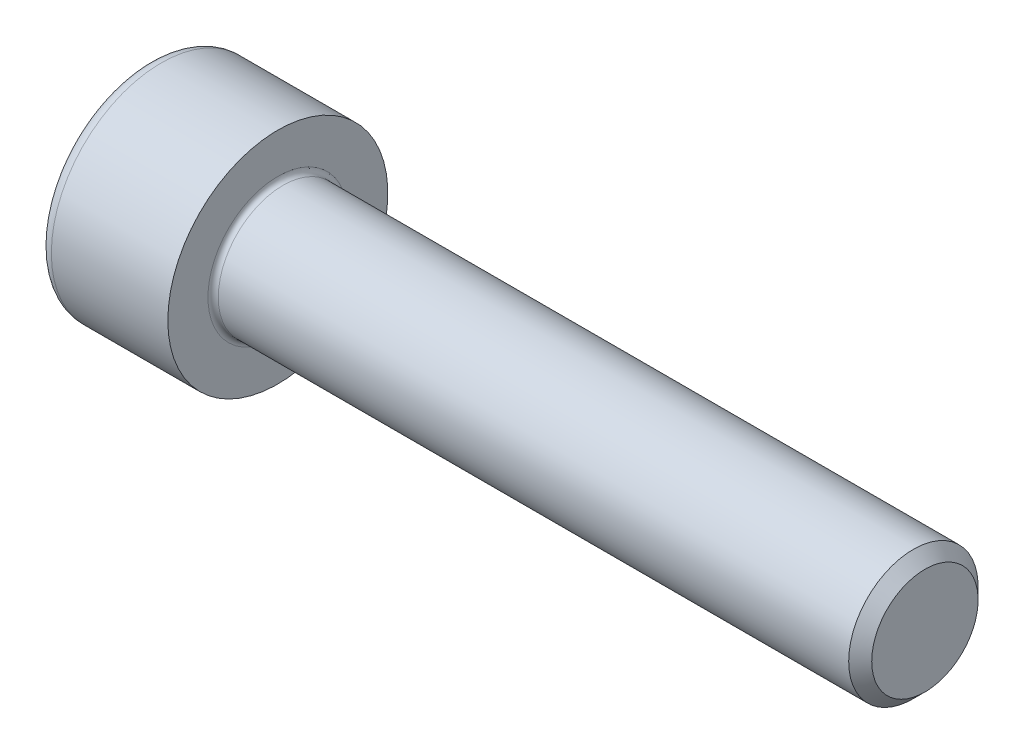
ISO-10303-21;
HEADER;
FILE_DESCRIPTION(('STEP AP214'),'2;1');
FILE_NAME('part.step','',(''),(''),'','','');
FILE_SCHEMA(('AUTOMOTIVE_DESIGN { 1 0 10303 214 1 1 1 1 }'));
ENDSEC;
DATA;
#1=APPLICATION_CONTEXT('core data for automotive mechanical design processes');
#2=APPLICATION_PROTOCOL_DEFINITION('international standard','automotive_design',2000,#1);
#3=PRODUCT_CONTEXT('',#1,'mechanical');
#4=PRODUCT('Part','Part','',(#3));
#5=PRODUCT_RELATED_PRODUCT_CATEGORY('part','',(#4));
#6=PRODUCT_DEFINITION_FORMATION('','',#4);
#7=PRODUCT_DEFINITION_CONTEXT('part definition',#1,'design');
#8=PRODUCT_DEFINITION('design','',#6,#7);
#9=PRODUCT_DEFINITION_SHAPE('','',#8);
#10=(LENGTH_UNIT() NAMED_UNIT(*) SI_UNIT(.MILLI.,.METRE.));
#11=(NAMED_UNIT(*) PLANE_ANGLE_UNIT() SI_UNIT($,.RADIAN.));
#12=(NAMED_UNIT(*) SI_UNIT($,.STERADIAN.) SOLID_ANGLE_UNIT());
#13=UNCERTAINTY_MEASURE_WITH_UNIT(LENGTH_MEASURE(1.E-05),#10,'distance_accuracy_value','');
#14=(GEOMETRIC_REPRESENTATION_CONTEXT(3) GLOBAL_UNCERTAINTY_ASSIGNED_CONTEXT((#13)) GLOBAL_UNIT_ASSIGNED_CONTEXT((#10,
#11,#12)) REPRESENTATION_CONTEXT('',''));
#15=CARTESIAN_POINT('',(0.,0.,0.));
#16=DIRECTION('',(0.,0.,1.));
#17=DIRECTION('',(1.,0.,0.));
#18=AXIS2_PLACEMENT_3D('',#15,#16,#17);
#19=CARTESIAN_POINT('',(0.,0.,0.));
#20=DIRECTION('',(-1.,0.,0.));
#21=DIRECTION('',(0.,0.,1.));
#22=AXIS2_PLACEMENT_3D('',#19,#20,#21);
#23=PLANE('',#22);
#24=DIRECTION('',(0.,-0.499999999999999,0.866025403784439));
#25=VECTOR('',#24,1.);
#26=CARTESIAN_POINT('',(0.,2.32094808214229,0.));
#27=LINE('',#26,#25);
#28=CARTESIAN_POINT('',(0.,2.32094808214229,0.));
#29=VERTEX_POINT('',#28);
#30=CARTESIAN_POINT('',(0.,1.16047404107114,2.01));
#31=VERTEX_POINT('',#30);
#32=EDGE_CURVE('E262',#29,#31,#27,.T.);
#33=ORIENTED_EDGE('',*,*,#32,.T.);
#34=DIRECTION('',(0.,1.,0.));
#35=VECTOR('',#34,1.);
#36=CARTESIAN_POINT('',(0.,-1.16047404107115,2.01));
#37=LINE('',#36,#35);
#38=CARTESIAN_POINT('',(0.,-1.16047404107115,2.01));
#39=VERTEX_POINT('',#38);
#40=EDGE_CURVE('E134',#39,#31,#37,.T.);
#41=ORIENTED_EDGE('',*,*,#40,.F.);
#42=DIRECTION('',(0.,-0.500000000000001,-0.866025403784438));
#43=VECTOR('',#42,1.);
#44=CARTESIAN_POINT('',(0.,-1.16047404107115,2.01));
#45=LINE('',#44,#43);
#46=CARTESIAN_POINT('',(0.,-2.3209480821423,0.));
#47=VERTEX_POINT('',#46);
#48=EDGE_CURVE('E265',#39,#47,#45,.T.);
#49=ORIENTED_EDGE('',*,*,#48,.T.);
#50=DIRECTION('',(0.,0.499999999999999,-0.866025403784439));
#51=VECTOR('',#50,1.);
#52=CARTESIAN_POINT('',(0.,-2.3209480821423,0.));
#53=LINE('',#52,#51);
#54=CARTESIAN_POINT('',(0.,-1.16047404107116,-2.01));
#55=VERTEX_POINT('',#54);
#56=EDGE_CURVE('E268',#47,#55,#53,.T.);
#57=ORIENTED_EDGE('',*,*,#56,.T.);
#58=DIRECTION('',(0.,-1.,0.));
#59=VECTOR('',#58,1.);
#60=CARTESIAN_POINT('',(0.,1.16047404107114,-2.01));
#61=LINE('',#60,#59);
#62=CARTESIAN_POINT('',(0.,1.16047404107114,-2.01));
#63=VERTEX_POINT('',#62);
#64=EDGE_CURVE('E271',#63,#55,#61,.T.);
#65=ORIENTED_EDGE('',*,*,#64,.F.);
#66=DIRECTION('',(0.,-0.500000000000001,-0.866025403784438));
#67=VECTOR('',#66,1.);
#68=CARTESIAN_POINT('',(0.,2.32094808214229,0.));
#69=LINE('',#68,#67);
#70=EDGE_CURVE('E129',#29,#63,#69,.T.);
#71=ORIENTED_EDGE('',*,*,#70,.F.);
#72=EDGE_LOOP('',(#33,#41,#49,#57,#65,#71));
#73=FACE_BOUND('',#72,.T.);
#74=CARTESIAN_POINT('',(0.,0.,0.));
#75=DIRECTION('',(-1.,0.,0.));
#76=DIRECTION('',(0.,0.,1.));
#77=AXIS2_PLACEMENT_3D('',#74,#75,#76);
#78=CIRCLE('',#77,3.75);
#79=CARTESIAN_POINT('',(0.,0.,3.75));
#80=VERTEX_POINT('',#79);
#81=EDGE_CURVE('E46',#80,#80,#78,.T.);
#82=ORIENTED_EDGE('',*,*,#81,.T.);
#83=EDGE_LOOP('',(#82));
#84=FACE_BOUND('',#83,.T.);
#85=ADVANCED_FACE('F38',(#73,#84),#23,.T.);
#86=CARTESIAN_POINT('',(-31.75,0.,0.));
#87=DIRECTION('',(-1.,0.,0.));
#88=DIRECTION('',(0.,0.,1.));
#89=AXIS2_PLACEMENT_3D('',#86,#87,#88);
#90=CYLINDRICAL_SURFACE('',#89,4.25);
#91=CARTESIAN_POINT('',(0.5,0.,0.));
#92=DIRECTION('',(-1.,0.,0.));
#93=DIRECTION('',(0.,0.,1.));
#94=AXIS2_PLACEMENT_3D('',#91,#92,#93);
#95=CIRCLE('',#94,4.25);
#96=CARTESIAN_POINT('',(0.5,0.,4.25));
#97=VERTEX_POINT('',#96);
#98=EDGE_CURVE('E11',#97,#97,#95,.F.);
#99=ORIENTED_EDGE('',*,*,#98,.T.);
#100=EDGE_LOOP('',(#99));
#101=FACE_BOUND('',#100,.T.);
#102=CARTESIAN_POINT('',(5.,0.,0.));
#103=DIRECTION('',(-1.,0.,0.));
#104=DIRECTION('',(0.,0.,1.));
#105=AXIS2_PLACEMENT_3D('',#102,#103,#104);
#106=CIRCLE('',#105,4.25);
#107=CARTESIAN_POINT('',(5.,0.,4.25));
#108=VERTEX_POINT('',#107);
#109=EDGE_CURVE('E152',#108,#108,#106,.T.);
#110=ORIENTED_EDGE('',*,*,#109,.T.);
#111=EDGE_LOOP('',(#110));
#112=FACE_BOUND('',#111,.T.);
#113=ADVANCED_FACE('F176',(#101,#112),#90,.T.);
#114=CARTESIAN_POINT('',(5.,4.25,0.));
#115=DIRECTION('',(1.,0.,0.));
#116=DIRECTION('',(0.,0.,-1.));
#117=AXIS2_PLACEMENT_3D('',#114,#115,#116);
#118=PLANE('',#117);
#119=CARTESIAN_POINT('',(5.,0.,0.));
#120=DIRECTION('',(1.,0.,0.));
#121=DIRECTION('',(0.,0.,-1.));
#122=AXIS2_PLACEMENT_3D('',#119,#120,#121);
#123=CIRCLE('',#122,2.69999999999999);
#124=CARTESIAN_POINT('',(5.,0.,-2.69999999999999));
#125=VERTEX_POINT('',#124);
#126=EDGE_CURVE('E155',#125,#125,#123,.F.);
#127=ORIENTED_EDGE('',*,*,#126,.T.);
#128=EDGE_LOOP('',(#127));
#129=FACE_BOUND('',#128,.T.);
#130=ORIENTED_EDGE('',*,*,#109,.F.);
#131=EDGE_LOOP('',(#130));
#132=FACE_BOUND('',#131,.T.);
#133=ADVANCED_FACE('F182',(#129,#132),#118,.T.);
#134=CARTESIAN_POINT('',(-31.75,0.,0.));
#135=DIRECTION('',(-1.,0.,0.));
#136=DIRECTION('',(0.,0.,1.));
#137=AXIS2_PLACEMENT_3D('',#134,#135,#136);
#138=CYLINDRICAL_SURFACE('',#137,2.49999999999999);
#139=CARTESIAN_POINT('',(5.2,0.,0.));
#140=DIRECTION('',(1.,0.,0.));
#141=DIRECTION('',(0.,0.,-1.));
#142=AXIS2_PLACEMENT_3D('',#139,#140,#141);
#143=CIRCLE('',#142,2.49999999999999);
#144=CARTESIAN_POINT('',(5.2,0.,-2.49999999999999));
#145=VERTEX_POINT('',#144);
#146=EDGE_CURVE('E158',#145,#145,#143,.T.);
#147=ORIENTED_EDGE('',*,*,#146,.T.);
#148=EDGE_LOOP('',(#147));
#149=FACE_BOUND('',#148,.T.);
#150=CARTESIAN_POINT('',(29.555,0.,0.));
#151=DIRECTION('',(-1.,0.,0.));
#152=DIRECTION('',(0.,0.,1.));
#153=AXIS2_PLACEMENT_3D('',#150,#151,#152);
#154=CIRCLE('',#153,2.49999999999998);
#155=CARTESIAN_POINT('',(29.555,0.,2.49999999999998));
#156=VERTEX_POINT('',#155);
#157=EDGE_CURVE('E149',#156,#156,#154,.T.);
#158=ORIENTED_EDGE('',*,*,#157,.T.);
#159=EDGE_LOOP('',(#158));
#160=FACE_BOUND('',#159,.T.);
#161=ADVANCED_FACE('F188',(#149,#160),#138,.T.);
#162=CARTESIAN_POINT('',(30.,0.,0.));
#163=DIRECTION('',(-1.,0.,0.));
#164=DIRECTION('',(0.,0.,1.));
#165=AXIS2_PLACEMENT_3D('',#162,#163,#164);
#166=CONICAL_SURFACE('',#165,2.055,0.785398163397404);
#167=ORIENTED_EDGE('',*,*,#157,.F.);
#168=EDGE_LOOP('',(#167));
#169=FACE_BOUND('',#168,.T.);
#170=CARTESIAN_POINT('',(30.,0.,0.));
#171=DIRECTION('',(-1.,0.,0.));
#172=DIRECTION('',(0.,0.,1.));
#173=AXIS2_PLACEMENT_3D('',#170,#171,#172);
#174=CIRCLE('',#173,2.055);
#175=CARTESIAN_POINT('',(30.,0.,2.055));
#176=VERTEX_POINT('',#175);
#177=EDGE_CURVE('E145',#176,#176,#174,.T.);
#178=ORIENTED_EDGE('',*,*,#177,.T.);
#179=EDGE_LOOP('',(#178));
#180=FACE_BOUND('',#179,.T.);
#181=ADVANCED_FACE('F192',(#169,#180),#166,.T.);
#182=CARTESIAN_POINT('',(30.,2.055,0.));
#183=DIRECTION('',(1.,0.,0.));
#184=DIRECTION('',(0.,0.,-1.));
#185=AXIS2_PLACEMENT_3D('',#182,#183,#184);
#186=PLANE('',#185);
#187=ORIENTED_EDGE('',*,*,#177,.F.);
#188=EDGE_LOOP('',(#187));
#189=FACE_BOUND('',#188,.T.);
#190=ADVANCED_FACE('F172',(#189),#186,.T.);
#191=CARTESIAN_POINT('',(5.2,0.,0.));
#192=DIRECTION('',(1.,0.,0.));
#193=DIRECTION('',(0.,0.,-1.));
#194=AXIS2_PLACEMENT_3D('',#191,#192,#193);
#195=TOROIDAL_SURFACE('',#194,2.69999999999999,0.2);
#196=ORIENTED_EDGE('',*,*,#146,.F.);
#197=EDGE_LOOP('',(#196));
#198=FACE_BOUND('',#197,.T.);
#199=ORIENTED_EDGE('',*,*,#126,.F.);
#200=EDGE_LOOP('',(#199));
#201=FACE_BOUND('',#200,.T.);
#202=ADVANCED_FACE('F165',(#198,#201),#195,.F.);
#203=CARTESIAN_POINT('',(0.5,0.,0.));
#204=DIRECTION('',(-1.,0.,0.));
#205=DIRECTION('',(0.,0.,1.));
#206=AXIS2_PLACEMENT_3D('',#203,#204,#205);
#207=TOROIDAL_SURFACE('',#206,3.75,0.5);
#208=ORIENTED_EDGE('',*,*,#98,.F.);
#209=EDGE_LOOP('',(#208));
#210=FACE_BOUND('',#209,.T.);
#211=ORIENTED_EDGE('',*,*,#81,.F.);
#212=EDGE_LOOP('',(#211));
#213=FACE_BOUND('',#212,.T.);
#214=ADVANCED_FACE('F40',(#210,#213),#207,.T.);
#215=CARTESIAN_POINT('',(2.5,2.32094808214229,0.));
#216=DIRECTION('',(0.,-0.866025403784439,-0.499999999999999));
#217=DIRECTION('',(0.,0.499999999999999,-0.866025403784439));
#218=AXIS2_PLACEMENT_3D('',#215,#216,#217);
#219=PLANE('',#218);
#220=ORIENTED_EDGE('',*,*,#32,.F.);
#221=DIRECTION('',(-1.,0.,0.));
#222=VECTOR('',#221,1.);
#223=CARTESIAN_POINT('',(2.5,2.32094808214229,0.));
#224=LINE('',#223,#222);
#225=CARTESIAN_POINT('',(2.5,2.32094808214229,0.));
#226=VERTEX_POINT('',#225);
#227=EDGE_CURVE('E252',#226,#29,#224,.T.);
#228=ORIENTED_EDGE('',*,*,#227,.F.);
#229=DIRECTION('',(0.,-0.499999999999999,0.866025403784439));
#230=VECTOR('',#229,1.);
#231=CARTESIAN_POINT('',(2.5,2.32094808214229,0.));
#232=LINE('',#231,#230);
#233=CARTESIAN_POINT('',(2.5,1.74071106160672,1.00499999999999));
#234=VERTEX_POINT('',#233);
#235=EDGE_CURVE('E121',#226,#234,#232,.T.);
#236=ORIENTED_EDGE('',*,*,#235,.T.);
#237=CARTESIAN_POINT('',(2.5,1.16047404107114,2.01));
#238=VERTEX_POINT('',#237);
#239=EDGE_CURVE('E112',#234,#238,#232,.T.);
#240=ORIENTED_EDGE('',*,*,#239,.T.);
#241=DIRECTION('',(-1.,0.,0.));
#242=VECTOR('',#241,1.);
#243=CARTESIAN_POINT('',(2.5,1.16047404107114,2.01));
#244=LINE('',#243,#242);
#245=EDGE_CURVE('E126',#238,#31,#244,.T.);
#246=ORIENTED_EDGE('',*,*,#245,.T.);
#247=EDGE_LOOP('',(#220,#228,#236,#240,#246));
#248=FACE_BOUND('',#247,.T.);
#249=ADVANCED_FACE('F125',(#248),#219,.T.);
#250=CARTESIAN_POINT('',(2.5,-1.16047404107115,2.01));
#251=DIRECTION('',(0.,0.,1.));
#252=DIRECTION('',(0.,-1.,0.));
#253=AXIS2_PLACEMENT_3D('',#250,#251,#252);
#254=PLANE('',#253);
#255=ORIENTED_EDGE('',*,*,#40,.T.);
#256=ORIENTED_EDGE('',*,*,#245,.F.);
#257=DIRECTION('',(0.,1.,0.));
#258=VECTOR('',#257,1.);
#259=CARTESIAN_POINT('',(2.5,-1.16047404107115,2.01));
#260=LINE('',#259,#258);
#261=CARTESIAN_POINT('',(2.5,0.,2.01));
#262=VERTEX_POINT('',#261);
#263=EDGE_CURVE('E109',#262,#238,#260,.T.);
#264=ORIENTED_EDGE('',*,*,#263,.F.);
#265=CARTESIAN_POINT('',(2.5,-1.16047404107115,2.01));
#266=VERTEX_POINT('',#265);
#267=EDGE_CURVE('E120',#266,#262,#260,.T.);
#268=ORIENTED_EDGE('',*,*,#267,.F.);
#269=DIRECTION('',(-1.,0.,0.));
#270=VECTOR('',#269,1.);
#271=CARTESIAN_POINT('',(2.5,-1.16047404107115,2.01));
#272=LINE('',#271,#270);
#273=EDGE_CURVE('E136',#266,#39,#272,.T.);
#274=ORIENTED_EDGE('',*,*,#273,.T.);
#275=EDGE_LOOP('',(#255,#256,#264,#268,#274));
#276=FACE_BOUND('',#275,.T.);
#277=ADVANCED_FACE('F131',(#276),#254,.F.);
#278=CARTESIAN_POINT('',(2.5,-1.16047404107115,2.01));
#279=DIRECTION('',(0.,0.866025403784438,-0.500000000000001));
#280=DIRECTION('',(0.,0.500000000000001,0.866025403784438));
#281=AXIS2_PLACEMENT_3D('',#278,#279,#280);
#282=PLANE('',#281);
#283=ORIENTED_EDGE('',*,*,#48,.F.);
#284=ORIENTED_EDGE('',*,*,#273,.F.);
#285=DIRECTION('',(0.,-0.500000000000001,-0.866025403784438));
#286=VECTOR('',#285,1.);
#287=CARTESIAN_POINT('',(2.5,-1.16047404107115,2.01));
#288=LINE('',#287,#286);
#289=CARTESIAN_POINT('',(2.5,-1.74071106160672,1.005));
#290=VERTEX_POINT('',#289);
#291=EDGE_CURVE('E291',#266,#290,#288,.T.);
#292=ORIENTED_EDGE('',*,*,#291,.T.);
#293=CARTESIAN_POINT('',(2.5,-2.3209480821423,0.));
#294=VERTEX_POINT('',#293);
#295=EDGE_CURVE('E280',#290,#294,#288,.T.);
#296=ORIENTED_EDGE('',*,*,#295,.T.);
#297=DIRECTION('',(-1.,0.,0.));
#298=VECTOR('',#297,1.);
#299=CARTESIAN_POINT('',(2.5,-2.3209480821423,0.));
#300=LINE('',#299,#298);
#301=EDGE_CURVE('E141',#294,#47,#300,.T.);
#302=ORIENTED_EDGE('',*,*,#301,.T.);
#303=EDGE_LOOP('',(#283,#284,#292,#296,#302));
#304=FACE_BOUND('',#303,.T.);
#305=ADVANCED_FACE('F206',(#304),#282,.T.);
#306=CARTESIAN_POINT('',(2.5,-2.3209480821423,0.));
#307=DIRECTION('',(0.,0.866025403784439,0.499999999999999));
#308=DIRECTION('',(0.,-0.499999999999999,0.866025403784439));
#309=AXIS2_PLACEMENT_3D('',#306,#307,#308);
#310=PLANE('',#309);
#311=ORIENTED_EDGE('',*,*,#56,.F.);
#312=ORIENTED_EDGE('',*,*,#301,.F.);
#313=DIRECTION('',(0.,0.499999999999999,-0.866025403784439));
#314=VECTOR('',#313,1.);
#315=CARTESIAN_POINT('',(2.5,-2.3209480821423,0.));
#316=LINE('',#315,#314);
#317=CARTESIAN_POINT('',(2.5,-1.74071106160673,-1.005));
#318=VERTEX_POINT('',#317);
#319=EDGE_CURVE('E258',#294,#318,#316,.T.);
#320=ORIENTED_EDGE('',*,*,#319,.T.);
#321=CARTESIAN_POINT('',(2.5,-1.16047404107116,-2.01));
#322=VERTEX_POINT('',#321);
#323=EDGE_CURVE('E290',#318,#322,#316,.T.);
#324=ORIENTED_EDGE('',*,*,#323,.T.);
#325=DIRECTION('',(-1.,0.,0.));
#326=VECTOR('',#325,1.);
#327=CARTESIAN_POINT('',(2.5,-1.16047404107116,-2.01));
#328=LINE('',#327,#326);
#329=EDGE_CURVE('E251',#322,#55,#328,.T.);
#330=ORIENTED_EDGE('',*,*,#329,.T.);
#331=EDGE_LOOP('',(#311,#312,#320,#324,#330));
#332=FACE_BOUND('',#331,.T.);
#333=ADVANCED_FACE('F209',(#332),#310,.T.);
#334=CARTESIAN_POINT('',(2.5,1.16047404107114,-2.01));
#335=DIRECTION('',(0.,0.,-1.));
#336=DIRECTION('',(0.,1.,0.));
#337=AXIS2_PLACEMENT_3D('',#334,#335,#336);
#338=PLANE('',#337);
#339=ORIENTED_EDGE('',*,*,#64,.T.);
#340=ORIENTED_EDGE('',*,*,#329,.F.);
#341=DIRECTION('',(0.,-1.,0.));
#342=VECTOR('',#341,1.);
#343=CARTESIAN_POINT('',(2.5,1.16047404107114,-2.01));
#344=LINE('',#343,#342);
#345=CARTESIAN_POINT('',(2.5,0.,-2.01));
#346=VERTEX_POINT('',#345);
#347=EDGE_CURVE('E255',#346,#322,#344,.T.);
#348=ORIENTED_EDGE('',*,*,#347,.F.);
#349=CARTESIAN_POINT('',(2.5,1.16047404107114,-2.01));
#350=VERTEX_POINT('',#349);
#351=EDGE_CURVE('E53',#350,#346,#344,.T.);
#352=ORIENTED_EDGE('',*,*,#351,.F.);
#353=DIRECTION('',(-1.,0.,0.));
#354=VECTOR('',#353,1.);
#355=CARTESIAN_POINT('',(2.5,1.16047404107114,-2.01));
#356=LINE('',#355,#354);
#357=EDGE_CURVE('E248',#350,#63,#356,.T.);
#358=ORIENTED_EDGE('',*,*,#357,.T.);
#359=EDGE_LOOP('',(#339,#340,#348,#352,#358));
#360=FACE_BOUND('',#359,.T.);
#361=ADVANCED_FACE('F213',(#360),#338,.F.);
#362=CARTESIAN_POINT('',(2.5,2.32094808214229,0.));
#363=DIRECTION('',(0.,0.866025403784438,-0.500000000000001));
#364=DIRECTION('',(0.,0.500000000000001,0.866025403784438));
#365=AXIS2_PLACEMENT_3D('',#362,#363,#364);
#366=PLANE('',#365);
#367=ORIENTED_EDGE('',*,*,#70,.T.);
#368=ORIENTED_EDGE('',*,*,#357,.F.);
#369=DIRECTION('',(0.,-0.500000000000001,-0.866025403784438));
#370=VECTOR('',#369,1.);
#371=CARTESIAN_POINT('',(2.5,2.32094808214229,0.));
#372=LINE('',#371,#370);
#373=CARTESIAN_POINT('',(2.5,1.74071106160671,-1.005));
#374=VERTEX_POINT('',#373);
#375=EDGE_CURVE('E238',#374,#350,#372,.T.);
#376=ORIENTED_EDGE('',*,*,#375,.F.);
#377=EDGE_CURVE('E244',#226,#374,#372,.T.);
#378=ORIENTED_EDGE('',*,*,#377,.F.);
#379=ORIENTED_EDGE('',*,*,#227,.T.);
#380=EDGE_LOOP('',(#367,#368,#376,#378,#379));
#381=FACE_BOUND('',#380,.T.);
#382=ADVANCED_FACE('F217',(#381),#366,.F.);
#383=CARTESIAN_POINT('',(2.5,3.48142212321343,-2.01));
#384=DIRECTION('',(1.,0.,0.));
#385=DIRECTION('',(0.,0.,-1.));
#386=AXIS2_PLACEMENT_3D('',#383,#384,#385);
#387=PLANE('',#386);
#388=ORIENTED_EDGE('',*,*,#347,.T.);
#389=ORIENTED_EDGE('',*,*,#323,.F.);
#390=CARTESIAN_POINT('',(2.5,0.,0.));
#391=DIRECTION('',(-1.,0.,0.));
#392=DIRECTION('',(0.,0.,1.));
#393=AXIS2_PLACEMENT_3D('',#390,#391,#392);
#394=CIRCLE('',#393,2.01);
#395=EDGE_CURVE('E286',#346,#318,#394,.T.);
#396=ORIENTED_EDGE('',*,*,#395,.F.);
#397=EDGE_LOOP('',(#388,#389,#396));
#398=FACE_BOUND('',#397,.T.);
#399=ADVANCED_FACE('F221',(#398),#387,.F.);
#400=ORIENTED_EDGE('',*,*,#319,.F.);
#401=ORIENTED_EDGE('',*,*,#295,.F.);
#402=EDGE_CURVE('E139',#318,#290,#394,.T.);
#403=ORIENTED_EDGE('',*,*,#402,.F.);
#404=EDGE_LOOP('',(#400,#401,#403));
#405=FACE_BOUND('',#404,.T.);
#406=ADVANCED_FACE('F224',(#405),#387,.F.);
#407=ORIENTED_EDGE('',*,*,#291,.F.);
#408=ORIENTED_EDGE('',*,*,#267,.T.);
#409=EDGE_CURVE('E135',#290,#262,#394,.T.);
#410=ORIENTED_EDGE('',*,*,#409,.F.);
#411=EDGE_LOOP('',(#407,#408,#410));
#412=FACE_BOUND('',#411,.T.);
#413=ADVANCED_FACE('F229',(#412),#387,.F.);
#414=ORIENTED_EDGE('',*,*,#263,.T.);
#415=ORIENTED_EDGE('',*,*,#239,.F.);
#416=EDGE_CURVE('E115',#262,#234,#394,.T.);
#417=ORIENTED_EDGE('',*,*,#416,.F.);
#418=EDGE_LOOP('',(#414,#415,#417));
#419=FACE_BOUND('',#418,.T.);
#420=ADVANCED_FACE('F111',(#419),#387,.F.);
#421=ORIENTED_EDGE('',*,*,#235,.F.);
#422=ORIENTED_EDGE('',*,*,#377,.T.);
#423=EDGE_CURVE('E146',#234,#374,#394,.T.);
#424=ORIENTED_EDGE('',*,*,#423,.F.);
#425=EDGE_LOOP('',(#421,#422,#424));
#426=FACE_BOUND('',#425,.T.);
#427=ADVANCED_FACE('F232',(#426),#387,.F.);
#428=ORIENTED_EDGE('',*,*,#375,.T.);
#429=ORIENTED_EDGE('',*,*,#351,.T.);
#430=EDGE_CURVE('E241',#374,#346,#394,.T.);
#431=ORIENTED_EDGE('',*,*,#430,.F.);
#432=EDGE_LOOP('',(#428,#429,#431));
#433=FACE_BOUND('',#432,.T.);
#434=ADVANCED_FACE('F202',(#433),#387,.F.);
#435=CARTESIAN_POINT('',(2.5,0.,0.));
#436=DIRECTION('',(-1.,0.,0.));
#437=DIRECTION('',(0.,0.,1.));
#438=AXIS2_PLACEMENT_3D('',#435,#436,#437);
#439=CONICAL_SURFACE('',#438,2.01,1.04719755119659);
#440=CARTESIAN_POINT('',(3.66047404107116,0.,0.));
#441=VERTEX_POINT('',#440);
#442=VERTEX_LOOP('',#441);
#443=FACE_BOUND('',#442,.T.);
#444=ORIENTED_EDGE('',*,*,#416,.T.);
#445=ORIENTED_EDGE('',*,*,#423,.T.);
#446=ORIENTED_EDGE('',*,*,#430,.T.);
#447=ORIENTED_EDGE('',*,*,#395,.T.);
#448=ORIENTED_EDGE('',*,*,#402,.T.);
#449=ORIENTED_EDGE('',*,*,#409,.T.);
#450=EDGE_LOOP('',(#444,#445,#446,#447,#448,#449));
#451=FACE_BOUND('',#450,.T.);
#452=ADVANCED_FACE('F200',(#443,#451),#439,.F.);
#453=CLOSED_SHELL('',(#85,#113,#133,#161,#181,#190,#202,#214,#249,#277,#305,#333,#361,#382,#399,
#406,#413,#420,#427,#434,#452));
#454=MANIFOLD_SOLID_BREP('B2',#453);
#455=ADVANCED_BREP_SHAPE_REPRESENTATION('',(#18,#454),#14);
#456=SHAPE_DEFINITION_REPRESENTATION(#9,#455);
ENDSEC;
END-ISO-10303-21;
